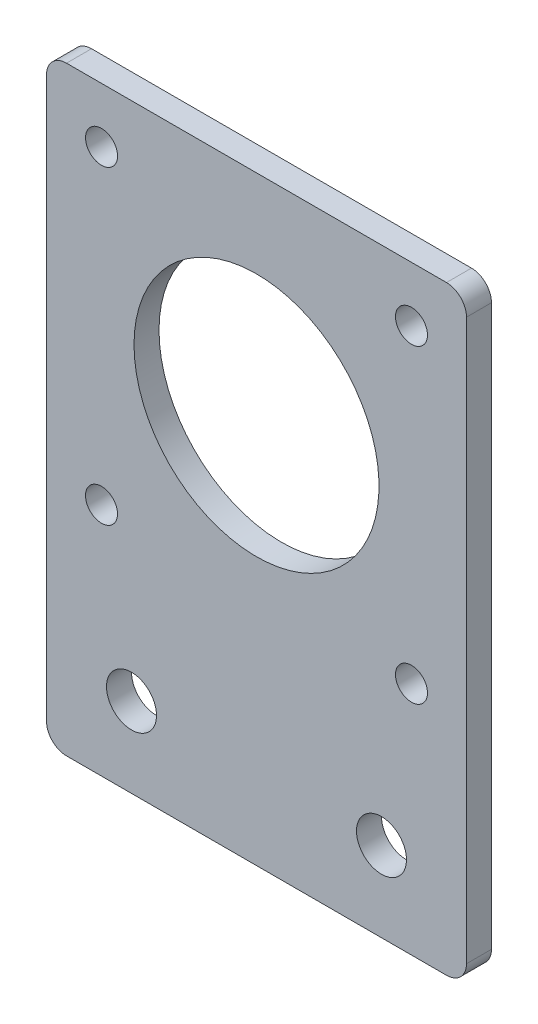
ISO-10303-21;
HEADER;
FILE_DESCRIPTION(('STEP AP214'),'2;1');
FILE_NAME('part.step','',(''),(''),'','','');
FILE_SCHEMA(('AUTOMOTIVE_DESIGN { 1 0 10303 214 1 1 1 1 }'));
ENDSEC;
DATA;
#1=APPLICATION_CONTEXT('core data for automotive mechanical design processes');
#2=APPLICATION_PROTOCOL_DEFINITION('international standard','automotive_design',2000,#1);
#3=PRODUCT_CONTEXT('',#1,'mechanical');
#4=PRODUCT('Part','Part','',(#3));
#5=PRODUCT_RELATED_PRODUCT_CATEGORY('part','',(#4));
#6=PRODUCT_DEFINITION_FORMATION('','',#4);
#7=PRODUCT_DEFINITION_CONTEXT('part definition',#1,'design');
#8=PRODUCT_DEFINITION('design','',#6,#7);
#9=PRODUCT_DEFINITION_SHAPE('','',#8);
#10=(LENGTH_UNIT() NAMED_UNIT(*) SI_UNIT(.MILLI.,.METRE.));
#11=(NAMED_UNIT(*) PLANE_ANGLE_UNIT() SI_UNIT($,.RADIAN.));
#12=(NAMED_UNIT(*) SI_UNIT($,.STERADIAN.) SOLID_ANGLE_UNIT());
#13=UNCERTAINTY_MEASURE_WITH_UNIT(LENGTH_MEASURE(1.E-05),#10,'distance_accuracy_value','');
#14=(GEOMETRIC_REPRESENTATION_CONTEXT(3) GLOBAL_UNCERTAINTY_ASSIGNED_CONTEXT((#13)) GLOBAL_UNIT_ASSIGNED_CONTEXT((#10,
#11,#12)) REPRESENTATION_CONTEXT('',''));
#15=CARTESIAN_POINT('',(0.,0.,0.));
#16=DIRECTION('',(0.,0.,1.));
#17=DIRECTION('',(1.,0.,0.));
#18=AXIS2_PLACEMENT_3D('',#15,#16,#17);
#19=CARTESIAN_POINT('',(-19.,19.,-1.25));
#20=DIRECTION('',(0.,0.,1.));
#21=DIRECTION('',(1.,0.,0.));
#22=AXIS2_PLACEMENT_3D('',#19,#20,#21);
#23=CYLINDRICAL_SURFACE('',#22,2.);
#24=CARTESIAN_POINT('',(-19.,19.,1.25));
#25=DIRECTION('',(0.,0.,1.));
#26=DIRECTION('',(1.,0.,0.));
#27=AXIS2_PLACEMENT_3D('',#24,#25,#26);
#28=CIRCLE('',#27,2.);
#29=CARTESIAN_POINT('',(-19.,21.,1.25));
#30=VERTEX_POINT('',#29);
#31=CARTESIAN_POINT('',(-21.,19.,1.25));
#32=VERTEX_POINT('',#31);
#33=EDGE_CURVE('E134',#30,#32,#28,.T.);
#34=ORIENTED_EDGE('',*,*,#33,.F.);
#35=DIRECTION('',(0.,0.,1.));
#36=VECTOR('',#35,1.);
#37=CARTESIAN_POINT('',(-19.,21.,-1.25));
#38=LINE('',#37,#36);
#39=CARTESIAN_POINT('',(-19.,21.,-1.25));
#40=VERTEX_POINT('',#39);
#41=EDGE_CURVE('E11',#40,#30,#38,.T.);
#42=ORIENTED_EDGE('',*,*,#41,.F.);
#43=CARTESIAN_POINT('',(-19.,19.,-1.25));
#44=DIRECTION('',(0.,0.,1.));
#45=DIRECTION('',(1.,0.,0.));
#46=AXIS2_PLACEMENT_3D('',#43,#44,#45);
#47=CIRCLE('',#46,2.);
#48=CARTESIAN_POINT('',(-21.,19.,-1.25));
#49=VERTEX_POINT('',#48);
#50=EDGE_CURVE('E155',#40,#49,#47,.T.);
#51=ORIENTED_EDGE('',*,*,#50,.T.);
#52=DIRECTION('',(0.,0.,1.));
#53=VECTOR('',#52,1.);
#54=CARTESIAN_POINT('',(-21.,19.,-1.25));
#55=LINE('',#54,#53);
#56=EDGE_CURVE('E40',#49,#32,#55,.T.);
#57=ORIENTED_EDGE('',*,*,#56,.T.);
#58=EDGE_LOOP('',(#34,#42,#51,#57));
#59=FACE_BOUND('',#58,.T.);
#60=ADVANCED_FACE('F37',(#59),#23,.T.);
#61=CARTESIAN_POINT('',(19.,21.,-1.25));
#62=DIRECTION('',(0.,1.,0.));
#63=DIRECTION('',(0.,0.,1.));
#64=AXIS2_PLACEMENT_3D('',#61,#62,#63);
#65=PLANE('',#64);
#66=DIRECTION('',(-1.,0.,0.));
#67=VECTOR('',#66,1.);
#68=CARTESIAN_POINT('',(19.,21.,1.25));
#69=LINE('',#68,#67);
#70=CARTESIAN_POINT('',(19.,21.,1.25));
#71=VERTEX_POINT('',#70);
#72=EDGE_CURVE('E153',#71,#30,#69,.T.);
#73=ORIENTED_EDGE('',*,*,#72,.F.);
#74=DIRECTION('',(0.,0.,1.));
#75=VECTOR('',#74,1.);
#76=CARTESIAN_POINT('',(19.,21.,-1.25));
#77=LINE('',#76,#75);
#78=CARTESIAN_POINT('',(19.,21.,-1.25));
#79=VERTEX_POINT('',#78);
#80=EDGE_CURVE('E46',#79,#71,#77,.T.);
#81=ORIENTED_EDGE('',*,*,#80,.F.);
#82=DIRECTION('',(-1.,0.,0.));
#83=VECTOR('',#82,1.);
#84=CARTESIAN_POINT('',(19.,21.,-1.25));
#85=LINE('',#84,#83);
#86=EDGE_CURVE('E124',#79,#40,#85,.T.);
#87=ORIENTED_EDGE('',*,*,#86,.T.);
#88=ORIENTED_EDGE('',*,*,#41,.T.);
#89=EDGE_LOOP('',(#73,#81,#87,#88));
#90=FACE_BOUND('',#89,.T.);
#91=ADVANCED_FACE('F167',(#90),#65,.T.);
#92=CARTESIAN_POINT('',(19.,19.,-1.25));
#93=DIRECTION('',(0.,0.,1.));
#94=DIRECTION('',(1.,0.,0.));
#95=AXIS2_PLACEMENT_3D('',#92,#93,#94);
#96=CYLINDRICAL_SURFACE('',#95,2.);
#97=CARTESIAN_POINT('',(19.,19.,1.25));
#98=DIRECTION('',(0.,0.,1.));
#99=DIRECTION('',(1.,0.,0.));
#100=AXIS2_PLACEMENT_3D('',#97,#98,#99);
#101=CIRCLE('',#100,2.);
#102=CARTESIAN_POINT('',(21.,19.,1.25));
#103=VERTEX_POINT('',#102);
#104=EDGE_CURVE('E111',#103,#71,#101,.T.);
#105=ORIENTED_EDGE('',*,*,#104,.F.);
#106=DIRECTION('',(0.,0.,1.));
#107=VECTOR('',#106,1.);
#108=CARTESIAN_POINT('',(21.,19.,-1.25));
#109=LINE('',#108,#107);
#110=CARTESIAN_POINT('',(21.,19.,-1.25));
#111=VERTEX_POINT('',#110);
#112=EDGE_CURVE('E106',#111,#103,#109,.T.);
#113=ORIENTED_EDGE('',*,*,#112,.F.);
#114=CARTESIAN_POINT('',(19.,19.,-1.25));
#115=DIRECTION('',(0.,0.,1.));
#116=DIRECTION('',(1.,0.,0.));
#117=AXIS2_PLACEMENT_3D('',#114,#115,#116);
#118=CIRCLE('',#117,2.);
#119=EDGE_CURVE('E109',#111,#79,#118,.T.);
#120=ORIENTED_EDGE('',*,*,#119,.T.);
#121=ORIENTED_EDGE('',*,*,#80,.T.);
#122=EDGE_LOOP('',(#105,#113,#120,#121));
#123=FACE_BOUND('',#122,.T.);
#124=ADVANCED_FACE('F108',(#123),#96,.T.);
#125=CARTESIAN_POINT('',(21.,-37.,-1.25));
#126=DIRECTION('',(1.,0.,0.));
#127=DIRECTION('',(0.,0.,-1.));
#128=AXIS2_PLACEMENT_3D('',#125,#126,#127);
#129=PLANE('',#128);
#130=DIRECTION('',(0.,1.,0.));
#131=VECTOR('',#130,1.);
#132=CARTESIAN_POINT('',(21.,-37.,1.25));
#133=LINE('',#132,#131);
#134=CARTESIAN_POINT('',(21.,-37.,1.25));
#135=VERTEX_POINT('',#134);
#136=EDGE_CURVE('E150',#135,#103,#133,.T.);
#137=ORIENTED_EDGE('',*,*,#136,.F.);
#138=DIRECTION('',(0.,0.,1.));
#139=VECTOR('',#138,1.);
#140=CARTESIAN_POINT('',(21.,-37.,-1.25));
#141=LINE('',#140,#139);
#142=CARTESIAN_POINT('',(21.,-37.,-1.25));
#143=VERTEX_POINT('',#142);
#144=EDGE_CURVE('E116',#143,#135,#141,.T.);
#145=ORIENTED_EDGE('',*,*,#144,.F.);
#146=DIRECTION('',(0.,1.,0.));
#147=VECTOR('',#146,1.);
#148=CARTESIAN_POINT('',(21.,-37.,-1.25));
#149=LINE('',#148,#147);
#150=EDGE_CURVE('E122',#143,#111,#149,.T.);
#151=ORIENTED_EDGE('',*,*,#150,.T.);
#152=ORIENTED_EDGE('',*,*,#112,.T.);
#153=EDGE_LOOP('',(#137,#145,#151,#152));
#154=FACE_BOUND('',#153,.T.);
#155=ADVANCED_FACE('F126',(#154),#129,.T.);
#156=CARTESIAN_POINT('',(19.,-37.,-1.25));
#157=DIRECTION('',(0.,0.,1.));
#158=DIRECTION('',(1.,0.,0.));
#159=AXIS2_PLACEMENT_3D('',#156,#157,#158);
#160=CYLINDRICAL_SURFACE('',#159,2.);
#161=CARTESIAN_POINT('',(19.,-37.,1.25));
#162=DIRECTION('',(0.,0.,1.));
#163=DIRECTION('',(1.,0.,0.));
#164=AXIS2_PLACEMENT_3D('',#161,#162,#163);
#165=CIRCLE('',#164,2.);
#166=CARTESIAN_POINT('',(19.,-39.,1.25));
#167=VERTEX_POINT('',#166);
#168=EDGE_CURVE('E147',#167,#135,#165,.T.);
#169=ORIENTED_EDGE('',*,*,#168,.F.);
#170=DIRECTION('',(0.,0.,1.));
#171=VECTOR('',#170,1.);
#172=CARTESIAN_POINT('',(19.,-39.,-1.25));
#173=LINE('',#172,#171);
#174=CARTESIAN_POINT('',(19.,-39.,-1.25));
#175=VERTEX_POINT('',#174);
#176=EDGE_CURVE('E159',#175,#167,#173,.T.);
#177=ORIENTED_EDGE('',*,*,#176,.F.);
#178=CARTESIAN_POINT('',(19.,-37.,-1.25));
#179=DIRECTION('',(0.,0.,1.));
#180=DIRECTION('',(1.,0.,0.));
#181=AXIS2_PLACEMENT_3D('',#178,#179,#180);
#182=CIRCLE('',#181,2.);
#183=EDGE_CURVE('E127',#175,#143,#182,.T.);
#184=ORIENTED_EDGE('',*,*,#183,.T.);
#185=ORIENTED_EDGE('',*,*,#144,.T.);
#186=EDGE_LOOP('',(#169,#177,#184,#185));
#187=FACE_BOUND('',#186,.T.);
#188=ADVANCED_FACE('F180',(#187),#160,.T.);
#189=CARTESIAN_POINT('',(-19.,-39.,-1.25));
#190=DIRECTION('',(0.,-1.,0.));
#191=DIRECTION('',(0.,0.,-1.));
#192=AXIS2_PLACEMENT_3D('',#189,#190,#191);
#193=PLANE('',#192);
#194=DIRECTION('',(1.,0.,0.));
#195=VECTOR('',#194,1.);
#196=CARTESIAN_POINT('',(-19.,-39.,1.25));
#197=LINE('',#196,#195);
#198=CARTESIAN_POINT('',(-19.,-39.,1.25));
#199=VERTEX_POINT('',#198);
#200=EDGE_CURVE('E144',#199,#167,#197,.T.);
#201=ORIENTED_EDGE('',*,*,#200,.F.);
#202=DIRECTION('',(0.,0.,1.));
#203=VECTOR('',#202,1.);
#204=CARTESIAN_POINT('',(-19.,-39.,-1.25));
#205=LINE('',#204,#203);
#206=CARTESIAN_POINT('',(-19.,-39.,-1.25));
#207=VERTEX_POINT('',#206);
#208=EDGE_CURVE('E161',#207,#199,#205,.T.);
#209=ORIENTED_EDGE('',*,*,#208,.F.);
#210=DIRECTION('',(1.,0.,0.));
#211=VECTOR('',#210,1.);
#212=CARTESIAN_POINT('',(-19.,-39.,-1.25));
#213=LINE('',#212,#211);
#214=EDGE_CURVE('E129',#207,#175,#213,.T.);
#215=ORIENTED_EDGE('',*,*,#214,.T.);
#216=ORIENTED_EDGE('',*,*,#176,.T.);
#217=EDGE_LOOP('',(#201,#209,#215,#216));
#218=FACE_BOUND('',#217,.T.);
#219=ADVANCED_FACE('F183',(#218),#193,.T.);
#220=CARTESIAN_POINT('',(-19.,-37.,-1.25));
#221=DIRECTION('',(0.,0.,1.));
#222=DIRECTION('',(1.,0.,0.));
#223=AXIS2_PLACEMENT_3D('',#220,#221,#222);
#224=CYLINDRICAL_SURFACE('',#223,2.);
#225=CARTESIAN_POINT('',(-19.,-37.,1.25));
#226=DIRECTION('',(0.,0.,1.));
#227=DIRECTION('',(1.,0.,0.));
#228=AXIS2_PLACEMENT_3D('',#225,#226,#227);
#229=CIRCLE('',#228,2.);
#230=CARTESIAN_POINT('',(-21.,-37.,1.25));
#231=VERTEX_POINT('',#230);
#232=EDGE_CURVE('E141',#231,#199,#229,.T.);
#233=ORIENTED_EDGE('',*,*,#232,.F.);
#234=DIRECTION('',(0.,0.,1.));
#235=VECTOR('',#234,1.);
#236=CARTESIAN_POINT('',(-21.,-37.,-1.25));
#237=LINE('',#236,#235);
#238=CARTESIAN_POINT('',(-21.,-37.,-1.25));
#239=VERTEX_POINT('',#238);
#240=EDGE_CURVE('E162',#239,#231,#237,.T.);
#241=ORIENTED_EDGE('',*,*,#240,.F.);
#242=CARTESIAN_POINT('',(-19.,-37.,-1.25));
#243=DIRECTION('',(0.,0.,1.));
#244=DIRECTION('',(1.,0.,0.));
#245=AXIS2_PLACEMENT_3D('',#242,#243,#244);
#246=CIRCLE('',#245,2.);
#247=EDGE_CURVE('E279',#239,#207,#246,.T.);
#248=ORIENTED_EDGE('',*,*,#247,.T.);
#249=ORIENTED_EDGE('',*,*,#208,.T.);
#250=EDGE_LOOP('',(#233,#241,#248,#249));
#251=FACE_BOUND('',#250,.T.);
#252=ADVANCED_FACE('F187',(#251),#224,.T.);
#253=CARTESIAN_POINT('',(-21.,19.,-1.25));
#254=DIRECTION('',(-1.,0.,0.));
#255=DIRECTION('',(0.,0.,1.));
#256=AXIS2_PLACEMENT_3D('',#253,#254,#255);
#257=PLANE('',#256);
#258=DIRECTION('',(0.,-1.,0.));
#259=VECTOR('',#258,1.);
#260=CARTESIAN_POINT('',(-21.,19.,1.25));
#261=LINE('',#260,#259);
#262=EDGE_CURVE('E137',#32,#231,#261,.T.);
#263=ORIENTED_EDGE('',*,*,#262,.F.);
#264=ORIENTED_EDGE('',*,*,#56,.F.);
#265=DIRECTION('',(0.,-1.,0.));
#266=VECTOR('',#265,1.);
#267=CARTESIAN_POINT('',(-21.,19.,-1.25));
#268=LINE('',#267,#266);
#269=EDGE_CURVE('E277',#49,#239,#268,.T.);
#270=ORIENTED_EDGE('',*,*,#269,.T.);
#271=ORIENTED_EDGE('',*,*,#240,.T.);
#272=EDGE_LOOP('',(#263,#264,#270,#271));
#273=FACE_BOUND('',#272,.T.);
#274=ADVANCED_FACE('F164',(#273),#257,.T.);
#275=CARTESIAN_POINT('',(-19.,19.,-1.25));
#276=DIRECTION('',(0.,0.,1.));
#277=DIRECTION('',(1.,0.,0.));
#278=AXIS2_PLACEMENT_3D('',#275,#276,#277);
#279=PLANE('',#278);
#280=CARTESIAN_POINT('',(12.5,-31.,-1.25));
#281=DIRECTION('',(0.,0.,1.));
#282=DIRECTION('',(-1.,0.,0.));
#283=AXIS2_PLACEMENT_3D('',#280,#281,#282);
#284=CIRCLE('',#283,2.5);
#285=CARTESIAN_POINT('',(10.,-31.,-1.25));
#286=VERTEX_POINT('',#285);
#287=EDGE_CURVE('E234',#286,#286,#284,.T.);
#288=ORIENTED_EDGE('',*,*,#287,.T.);
#289=EDGE_LOOP('',(#288));
#290=FACE_BOUND('',#289,.T.);
#291=CARTESIAN_POINT('',(15.5,15.5,-1.25));
#292=DIRECTION('',(0.,0.,1.));
#293=DIRECTION('',(-1.,0.,0.));
#294=AXIS2_PLACEMENT_3D('',#291,#292,#293);
#295=CIRCLE('',#294,1.6);
#296=CARTESIAN_POINT('',(13.9,15.5,-1.25));
#297=VERTEX_POINT('',#296);
#298=EDGE_CURVE('E242',#297,#297,#295,.T.);
#299=ORIENTED_EDGE('',*,*,#298,.T.);
#300=EDGE_LOOP('',(#299));
#301=FACE_BOUND('',#300,.T.);
#302=CARTESIAN_POINT('',(-15.5,-15.5,-1.25));
#303=DIRECTION('',(0.,0.,1.));
#304=DIRECTION('',(-1.,0.,0.));
#305=AXIS2_PLACEMENT_3D('',#302,#303,#304);
#306=CIRCLE('',#305,1.6);
#307=CARTESIAN_POINT('',(-17.1,-15.5,-1.25));
#308=VERTEX_POINT('',#307);
#309=EDGE_CURVE('E248',#308,#308,#306,.T.);
#310=ORIENTED_EDGE('',*,*,#309,.T.);
#311=EDGE_LOOP('',(#310));
#312=FACE_BOUND('',#311,.T.);
#313=CARTESIAN_POINT('',(0.,0.,-1.25));
#314=DIRECTION('',(0.,0.,1.));
#315=DIRECTION('',(-1.,0.,0.));
#316=AXIS2_PLACEMENT_3D('',#313,#314,#315);
#317=CIRCLE('',#316,12.25);
#318=CARTESIAN_POINT('',(-12.25,0.,-1.25));
#319=VERTEX_POINT('',#318);
#320=EDGE_CURVE('E254',#319,#319,#317,.T.);
#321=ORIENTED_EDGE('',*,*,#320,.T.);
#322=EDGE_LOOP('',(#321));
#323=FACE_BOUND('',#322,.T.);
#324=CARTESIAN_POINT('',(15.5,-15.5,-1.25));
#325=DIRECTION('',(0.,0.,1.));
#326=DIRECTION('',(-1.,0.,0.));
#327=AXIS2_PLACEMENT_3D('',#324,#325,#326);
#328=CIRCLE('',#327,1.6);
#329=CARTESIAN_POINT('',(13.9,-15.5,-1.25));
#330=VERTEX_POINT('',#329);
#331=EDGE_CURVE('E260',#330,#330,#328,.T.);
#332=ORIENTED_EDGE('',*,*,#331,.T.);
#333=EDGE_LOOP('',(#332));
#334=FACE_BOUND('',#333,.T.);
#335=CARTESIAN_POINT('',(-15.5,15.5,-1.25));
#336=DIRECTION('',(0.,0.,1.));
#337=DIRECTION('',(-1.,0.,0.));
#338=AXIS2_PLACEMENT_3D('',#335,#336,#337);
#339=CIRCLE('',#338,1.6);
#340=CARTESIAN_POINT('',(-17.1,15.5,-1.25));
#341=VERTEX_POINT('',#340);
#342=EDGE_CURVE('E266',#341,#341,#339,.T.);
#343=ORIENTED_EDGE('',*,*,#342,.T.);
#344=EDGE_LOOP('',(#343));
#345=FACE_BOUND('',#344,.T.);
#346=CARTESIAN_POINT('',(-12.5,-31.,-1.25));
#347=DIRECTION('',(0.,0.,1.));
#348=DIRECTION('',(-1.,0.,0.));
#349=AXIS2_PLACEMENT_3D('',#346,#347,#348);
#350=CIRCLE('',#349,2.5);
#351=CARTESIAN_POINT('',(-15.,-31.,-1.25));
#352=VERTEX_POINT('',#351);
#353=EDGE_CURVE('E138',#352,#352,#350,.T.);
#354=ORIENTED_EDGE('',*,*,#353,.T.);
#355=EDGE_LOOP('',(#354));
#356=FACE_BOUND('',#355,.T.);
#357=ORIENTED_EDGE('',*,*,#50,.F.);
#358=ORIENTED_EDGE('',*,*,#86,.F.);
#359=ORIENTED_EDGE('',*,*,#119,.F.);
#360=ORIENTED_EDGE('',*,*,#150,.F.);
#361=ORIENTED_EDGE('',*,*,#183,.F.);
#362=ORIENTED_EDGE('',*,*,#214,.F.);
#363=ORIENTED_EDGE('',*,*,#247,.F.);
#364=ORIENTED_EDGE('',*,*,#269,.F.);
#365=EDGE_LOOP('',(#357,#358,#359,#360,#361,#362,#363,#364));
#366=FACE_BOUND('',#365,.T.);
#367=ADVANCED_FACE('F120',(#290,#301,#312,#323,#334,#345,#356,#366),#279,.F.);
#368=CARTESIAN_POINT('',(-19.,19.,1.25));
#369=DIRECTION('',(0.,0.,1.));
#370=DIRECTION('',(1.,0.,0.));
#371=AXIS2_PLACEMENT_3D('',#368,#369,#370);
#372=PLANE('',#371);
#373=CARTESIAN_POINT('',(12.5,-31.,1.25));
#374=DIRECTION('',(0.,0.,1.));
#375=DIRECTION('',(-1.,0.,0.));
#376=AXIS2_PLACEMENT_3D('',#373,#374,#375);
#377=CIRCLE('',#376,2.5);
#378=CARTESIAN_POINT('',(10.,-31.,1.25));
#379=VERTEX_POINT('',#378);
#380=EDGE_CURVE('E237',#379,#379,#377,.T.);
#381=ORIENTED_EDGE('',*,*,#380,.F.);
#382=EDGE_LOOP('',(#381));
#383=FACE_BOUND('',#382,.T.);
#384=CARTESIAN_POINT('',(15.5,15.5,1.25));
#385=DIRECTION('',(0.,0.,1.));
#386=DIRECTION('',(-1.,0.,0.));
#387=AXIS2_PLACEMENT_3D('',#384,#385,#386);
#388=CIRCLE('',#387,1.6);
#389=CARTESIAN_POINT('',(13.9,15.5,1.25));
#390=VERTEX_POINT('',#389);
#391=EDGE_CURVE('E239',#390,#390,#388,.T.);
#392=ORIENTED_EDGE('',*,*,#391,.F.);
#393=EDGE_LOOP('',(#392));
#394=FACE_BOUND('',#393,.T.);
#395=CARTESIAN_POINT('',(-15.5,-15.5,1.25));
#396=DIRECTION('',(0.,0.,1.));
#397=DIRECTION('',(-1.,0.,0.));
#398=AXIS2_PLACEMENT_3D('',#395,#396,#397);
#399=CIRCLE('',#398,1.6);
#400=CARTESIAN_POINT('',(-17.1,-15.5,1.25));
#401=VERTEX_POINT('',#400);
#402=EDGE_CURVE('E245',#401,#401,#399,.T.);
#403=ORIENTED_EDGE('',*,*,#402,.F.);
#404=EDGE_LOOP('',(#403));
#405=FACE_BOUND('',#404,.T.);
#406=CARTESIAN_POINT('',(0.,0.,1.25));
#407=DIRECTION('',(0.,0.,1.));
#408=DIRECTION('',(-1.,0.,0.));
#409=AXIS2_PLACEMENT_3D('',#406,#407,#408);
#410=CIRCLE('',#409,12.25);
#411=CARTESIAN_POINT('',(-12.25,0.,1.25));
#412=VERTEX_POINT('',#411);
#413=EDGE_CURVE('E251',#412,#412,#410,.T.);
#414=ORIENTED_EDGE('',*,*,#413,.F.);
#415=EDGE_LOOP('',(#414));
#416=FACE_BOUND('',#415,.T.);
#417=CARTESIAN_POINT('',(15.5,-15.5,1.25));
#418=DIRECTION('',(0.,0.,1.));
#419=DIRECTION('',(-1.,0.,0.));
#420=AXIS2_PLACEMENT_3D('',#417,#418,#419);
#421=CIRCLE('',#420,1.6);
#422=CARTESIAN_POINT('',(13.9,-15.5,1.25));
#423=VERTEX_POINT('',#422);
#424=EDGE_CURVE('E257',#423,#423,#421,.T.);
#425=ORIENTED_EDGE('',*,*,#424,.F.);
#426=EDGE_LOOP('',(#425));
#427=FACE_BOUND('',#426,.T.);
#428=CARTESIAN_POINT('',(-15.5,15.5,1.25));
#429=DIRECTION('',(0.,0.,1.));
#430=DIRECTION('',(-1.,0.,0.));
#431=AXIS2_PLACEMENT_3D('',#428,#429,#430);
#432=CIRCLE('',#431,1.6);
#433=CARTESIAN_POINT('',(-17.1,15.5,1.25));
#434=VERTEX_POINT('',#433);
#435=EDGE_CURVE('E263',#434,#434,#432,.T.);
#436=ORIENTED_EDGE('',*,*,#435,.F.);
#437=EDGE_LOOP('',(#436));
#438=FACE_BOUND('',#437,.T.);
#439=CARTESIAN_POINT('',(-12.5,-31.,1.25));
#440=DIRECTION('',(0.,0.,1.));
#441=DIRECTION('',(-1.,0.,0.));
#442=AXIS2_PLACEMENT_3D('',#439,#440,#441);
#443=CIRCLE('',#442,2.5);
#444=CARTESIAN_POINT('',(-15.,-31.,1.25));
#445=VERTEX_POINT('',#444);
#446=EDGE_CURVE('E269',#445,#445,#443,.T.);
#447=ORIENTED_EDGE('',*,*,#446,.F.);
#448=EDGE_LOOP('',(#447));
#449=FACE_BOUND('',#448,.T.);
#450=ORIENTED_EDGE('',*,*,#33,.T.);
#451=ORIENTED_EDGE('',*,*,#262,.T.);
#452=ORIENTED_EDGE('',*,*,#232,.T.);
#453=ORIENTED_EDGE('',*,*,#200,.T.);
#454=ORIENTED_EDGE('',*,*,#168,.T.);
#455=ORIENTED_EDGE('',*,*,#136,.T.);
#456=ORIENTED_EDGE('',*,*,#104,.T.);
#457=ORIENTED_EDGE('',*,*,#72,.T.);
#458=EDGE_LOOP('',(#450,#451,#452,#453,#454,#455,#456,#457));
#459=FACE_BOUND('',#458,.T.);
#460=ADVANCED_FACE('F166',(#383,#394,#405,#416,#427,#438,#449,#459),#372,.T.);
#461=CARTESIAN_POINT('',(-12.5,-31.,-1.25));
#462=DIRECTION('',(0.,0.,1.));
#463=DIRECTION('',(1.,0.,0.));
#464=AXIS2_PLACEMENT_3D('',#461,#462,#463);
#465=CYLINDRICAL_SURFACE('',#464,2.5);
#466=ORIENTED_EDGE('',*,*,#353,.F.);
#467=EDGE_LOOP('',(#466));
#468=FACE_BOUND('',#467,.T.);
#469=ORIENTED_EDGE('',*,*,#446,.T.);
#470=EDGE_LOOP('',(#469));
#471=FACE_BOUND('',#470,.T.);
#472=ADVANCED_FACE('F199',(#468,#471),#465,.F.);
#473=CARTESIAN_POINT('',(-15.5,15.5,-1.25));
#474=DIRECTION('',(0.,0.,1.));
#475=DIRECTION('',(1.,0.,0.));
#476=AXIS2_PLACEMENT_3D('',#473,#474,#475);
#477=CYLINDRICAL_SURFACE('',#476,1.6);
#478=ORIENTED_EDGE('',*,*,#342,.F.);
#479=EDGE_LOOP('',(#478));
#480=FACE_BOUND('',#479,.T.);
#481=ORIENTED_EDGE('',*,*,#435,.T.);
#482=EDGE_LOOP('',(#481));
#483=FACE_BOUND('',#482,.T.);
#484=ADVANCED_FACE('F206',(#480,#483),#477,.F.);
#485=CARTESIAN_POINT('',(15.5,-15.5,-1.25));
#486=DIRECTION('',(0.,0.,1.));
#487=DIRECTION('',(1.,0.,0.));
#488=AXIS2_PLACEMENT_3D('',#485,#486,#487);
#489=CYLINDRICAL_SURFACE('',#488,1.6);
#490=ORIENTED_EDGE('',*,*,#331,.F.);
#491=EDGE_LOOP('',(#490));
#492=FACE_BOUND('',#491,.T.);
#493=ORIENTED_EDGE('',*,*,#424,.T.);
#494=EDGE_LOOP('',(#493));
#495=FACE_BOUND('',#494,.T.);
#496=ADVANCED_FACE('F210',(#492,#495),#489,.F.);
#497=CARTESIAN_POINT('',(0.,0.,-1.25));
#498=DIRECTION('',(0.,0.,1.));
#499=DIRECTION('',(1.,0.,0.));
#500=AXIS2_PLACEMENT_3D('',#497,#498,#499);
#501=CYLINDRICAL_SURFACE('',#500,12.25);
#502=ORIENTED_EDGE('',*,*,#320,.F.);
#503=EDGE_LOOP('',(#502));
#504=FACE_BOUND('',#503,.T.);
#505=ORIENTED_EDGE('',*,*,#413,.T.);
#506=EDGE_LOOP('',(#505));
#507=FACE_BOUND('',#506,.T.);
#508=ADVANCED_FACE('F214',(#504,#507),#501,.F.);
#509=CARTESIAN_POINT('',(-15.5,-15.5,-1.25));
#510=DIRECTION('',(0.,0.,1.));
#511=DIRECTION('',(1.,0.,0.));
#512=AXIS2_PLACEMENT_3D('',#509,#510,#511);
#513=CYLINDRICAL_SURFACE('',#512,1.6);
#514=ORIENTED_EDGE('',*,*,#309,.F.);
#515=EDGE_LOOP('',(#514));
#516=FACE_BOUND('',#515,.T.);
#517=ORIENTED_EDGE('',*,*,#402,.T.);
#518=EDGE_LOOP('',(#517));
#519=FACE_BOUND('',#518,.T.);
#520=ADVANCED_FACE('F218',(#516,#519),#513,.F.);
#521=CARTESIAN_POINT('',(15.5,15.5,-1.25));
#522=DIRECTION('',(0.,0.,1.));
#523=DIRECTION('',(1.,0.,0.));
#524=AXIS2_PLACEMENT_3D('',#521,#522,#523);
#525=CYLINDRICAL_SURFACE('',#524,1.6);
#526=ORIENTED_EDGE('',*,*,#298,.F.);
#527=EDGE_LOOP('',(#526));
#528=FACE_BOUND('',#527,.T.);
#529=ORIENTED_EDGE('',*,*,#391,.T.);
#530=EDGE_LOOP('',(#529));
#531=FACE_BOUND('',#530,.T.);
#532=ADVANCED_FACE('F222',(#528,#531),#525,.F.);
#533=CARTESIAN_POINT('',(12.5,-31.,-1.25));
#534=DIRECTION('',(0.,0.,1.));
#535=DIRECTION('',(1.,0.,0.));
#536=AXIS2_PLACEMENT_3D('',#533,#534,#535);
#537=CYLINDRICAL_SURFACE('',#536,2.5);
#538=ORIENTED_EDGE('',*,*,#287,.F.);
#539=EDGE_LOOP('',(#538));
#540=FACE_BOUND('',#539,.T.);
#541=ORIENTED_EDGE('',*,*,#380,.T.);
#542=EDGE_LOOP('',(#541));
#543=FACE_BOUND('',#542,.T.);
#544=ADVANCED_FACE('F226',(#540,#543),#537,.F.);
#545=CLOSED_SHELL('',(#60,#91,#124,#155,#188,#219,#252,#274,#367,#460,#472,#484,#496,#508,#520,
#532,#544));
#546=MANIFOLD_SOLID_BREP('B2',#545);
#547=ADVANCED_BREP_SHAPE_REPRESENTATION('',(#18,#546),#14);
#548=SHAPE_DEFINITION_REPRESENTATION(#9,#547);
ENDSEC;
END-ISO-10303-21;
